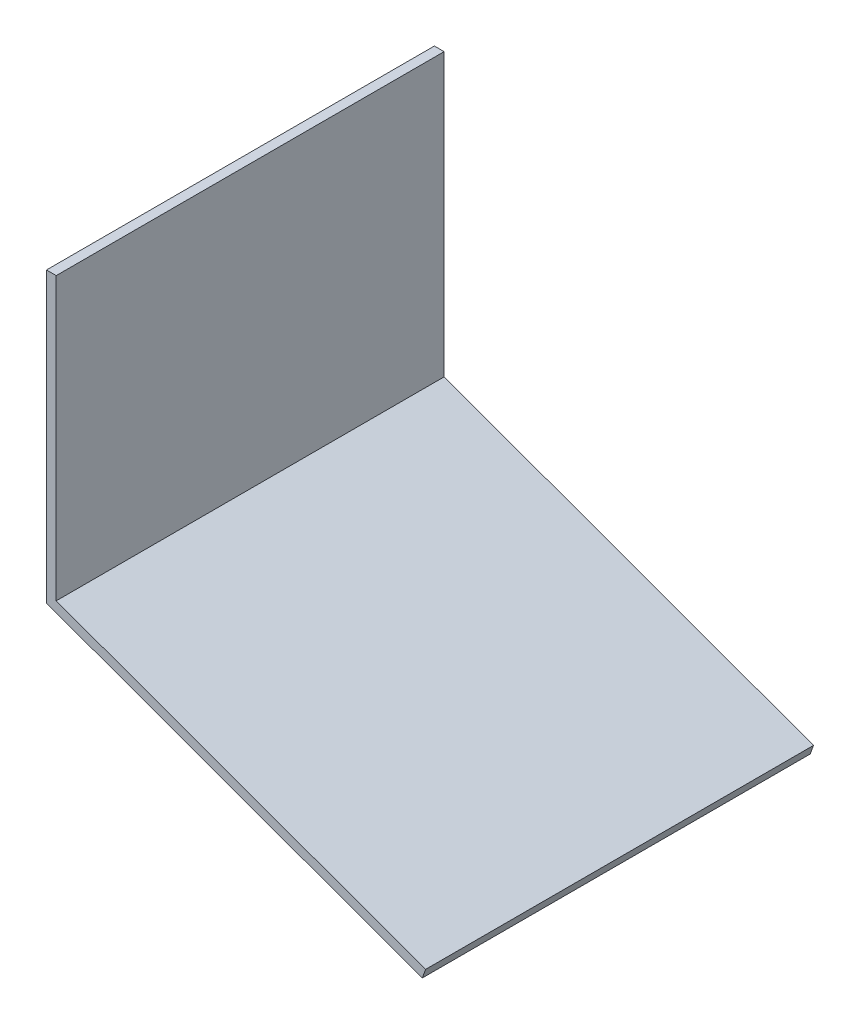
ISO-10303-21;
HEADER;
FILE_DESCRIPTION(('STEP AP214'),'2;1');
FILE_NAME('part.step','',(''),(''),'','','');
FILE_SCHEMA(('AUTOMOTIVE_DESIGN { 1 0 10303 214 1 1 1 1 }'));
ENDSEC;
DATA;
#1=APPLICATION_CONTEXT('core data for automotive mechanical design processes');
#2=APPLICATION_PROTOCOL_DEFINITION('international standard','automotive_design',2000,#1);
#3=PRODUCT_CONTEXT('',#1,'mechanical');
#4=PRODUCT('Part','Part','',(#3));
#5=PRODUCT_RELATED_PRODUCT_CATEGORY('part','',(#4));
#6=PRODUCT_DEFINITION_FORMATION('','',#4);
#7=PRODUCT_DEFINITION_CONTEXT('part definition',#1,'design');
#8=PRODUCT_DEFINITION('design','',#6,#7);
#9=PRODUCT_DEFINITION_SHAPE('','',#8);
#10=(LENGTH_UNIT() NAMED_UNIT(*) SI_UNIT(.MILLI.,.METRE.));
#11=(NAMED_UNIT(*) PLANE_ANGLE_UNIT() SI_UNIT($,.RADIAN.));
#12=(NAMED_UNIT(*) SI_UNIT($,.STERADIAN.) SOLID_ANGLE_UNIT());
#13=UNCERTAINTY_MEASURE_WITH_UNIT(LENGTH_MEASURE(1.E-05),#10,'distance_accuracy_value','');
#14=(GEOMETRIC_REPRESENTATION_CONTEXT(3) GLOBAL_UNCERTAINTY_ASSIGNED_CONTEXT((#13)) GLOBAL_UNIT_ASSIGNED_CONTEXT((#10,
#11,#12)) REPRESENTATION_CONTEXT('',''));
#15=CARTESIAN_POINT('',(0.,0.,0.));
#16=DIRECTION('',(0.,0.,1.));
#17=DIRECTION('',(1.,0.,0.));
#18=AXIS2_PLACEMENT_3D('',#15,#16,#17);
#19=CARTESIAN_POINT('',(-39.3731017802453,-108.176708075114,-469.281983346871));
#20=DIRECTION('',(0.342020143325665,0.93969262078591,0.));
#21=DIRECTION('',(-0.93969262078591,0.342020143325665,0.));
#22=AXIS2_PLACEMENT_3D('',#19,#20,#21);
#23=PLANE('',#22);
#24=DIRECTION('',(0.93969262078591,-0.342020143325665,0.));
#25=VECTOR('',#24,1.);
#26=CARTESIAN_POINT('',(-39.3731017802453,-108.176708075114,-177.));
#27=LINE('',#26,#25);
#28=CARTESIAN_POINT('',(-22.,-114.5,-177.));
#29=VERTEX_POINT('',#28);
#30=CARTESIAN_POINT('',(167.5,-183.472359393445,-177.));
#31=VERTEX_POINT('',#30);
#32=EDGE_CURVE('E48',#29,#31,#27,.T.);
#33=ORIENTED_EDGE('',*,*,#32,.F.);
#34=DIRECTION('',(0.,0.,1.));
#35=VECTOR('',#34,1.);
#36=CARTESIAN_POINT('',(-22.,-114.5,-469.281983346871));
#37=LINE('',#36,#35);
#38=CARTESIAN_POINT('',(-22.,-114.5,22.));
#39=VERTEX_POINT('',#38);
#40=EDGE_CURVE('E87',#29,#39,#37,.T.);
#41=ORIENTED_EDGE('',*,*,#40,.T.);
#42=DIRECTION('',(-0.93969262078591,0.342020143325665,0.));
#43=VECTOR('',#42,1.);
#44=CARTESIAN_POINT('',(-39.3731017802453,-108.176708075114,22.));
#45=LINE('',#44,#43);
#46=CARTESIAN_POINT('',(167.5,-183.472359393445,22.));
#47=VERTEX_POINT('',#46);
#48=EDGE_CURVE('E91',#47,#39,#45,.T.);
#49=ORIENTED_EDGE('',*,*,#48,.F.);
#50=DIRECTION('',(0.,0.,1.));
#51=VECTOR('',#50,1.);
#52=CARTESIAN_POINT('',(167.5,-183.472359393445,-469.281983346871));
#53=LINE('',#52,#51);
#54=EDGE_CURVE('E128',#31,#47,#53,.T.);
#55=ORIENTED_EDGE('',*,*,#54,.F.);
#56=EDGE_LOOP('',(#33,#41,#49,#55));
#57=FACE_BOUND('',#56,.T.);
#58=ADVANCED_FACE('F39',(#57),#23,.T.);
#59=CARTESIAN_POINT('',(206.873101780245,-75.2956513183295,-469.281983346871));
#60=DIRECTION('',(0.939692620785912,-0.34202014332566,0.));
#61=DIRECTION('',(0.34202014332566,0.939692620785912,0.));
#62=AXIS2_PLACEMENT_3D('',#59,#60,#61);
#63=PLANE('',#62);
#64=DIRECTION('',(-0.34202014332566,-0.939692620785912,0.));
#65=VECTOR('',#64,1.);
#66=CARTESIAN_POINT('',(206.873101780245,-75.2956513183295,-177.));
#67=LINE('',#66,#65);
#68=CARTESIAN_POINT('',(165.789899283372,-188.170822497374,-177.));
#69=VERTEX_POINT('',#68);
#70=EDGE_CURVE('E149',#31,#69,#67,.T.);
#71=ORIENTED_EDGE('',*,*,#70,.F.);
#72=ORIENTED_EDGE('',*,*,#54,.T.);
#73=DIRECTION('',(0.34202014332566,0.939692620785912,0.));
#74=VECTOR('',#73,1.);
#75=CARTESIAN_POINT('',(206.873101780245,-75.2956513183295,22.));
#76=LINE('',#75,#74);
#77=CARTESIAN_POINT('',(165.789899283372,-188.170822497374,22.));
#78=VERTEX_POINT('',#77);
#79=EDGE_CURVE('E98',#78,#47,#76,.T.);
#80=ORIENTED_EDGE('',*,*,#79,.F.);
#81=DIRECTION('',(0.,0.,1.));
#82=VECTOR('',#81,1.);
#83=CARTESIAN_POINT('',(165.789899283372,-188.170822497374,-469.281983346871));
#84=LINE('',#83,#82);
#85=EDGE_CURVE('E132',#69,#78,#84,.T.);
#86=ORIENTED_EDGE('',*,*,#85,.F.);
#87=EDGE_LOOP('',(#71,#72,#80,#86));
#88=FACE_BOUND('',#87,.T.);
#89=ADVANCED_FACE('F157',(#88),#63,.T.);
#90=CARTESIAN_POINT('',(-41.0832024968736,-112.875171179043,-469.281983346871));
#91=DIRECTION('',(-0.342020143325665,-0.93969262078591,0.));
#92=DIRECTION('',(0.93969262078591,-0.342020143325665,0.));
#93=AXIS2_PLACEMENT_3D('',#90,#91,#92);
#94=PLANE('',#93);
#95=DIRECTION('',(-0.93969262078591,0.342020143325665,0.));
#96=VECTOR('',#95,1.);
#97=CARTESIAN_POINT('',(-41.0832024968736,-112.875171179043,-177.));
#98=LINE('',#97,#96);
#99=CARTESIAN_POINT('',(-27.,-118.001037691049,-177.));
#100=VERTEX_POINT('',#99);
#101=EDGE_CURVE('E146',#69,#100,#98,.T.);
#102=ORIENTED_EDGE('',*,*,#101,.F.);
#103=ORIENTED_EDGE('',*,*,#85,.T.);
#104=DIRECTION('',(0.93969262078591,-0.342020143325665,0.));
#105=VECTOR('',#104,1.);
#106=CARTESIAN_POINT('',(-41.0832024968736,-112.875171179043,22.));
#107=LINE('',#106,#105);
#108=CARTESIAN_POINT('',(-27.,-118.001037691049,22.));
#109=VERTEX_POINT('',#108);
#110=EDGE_CURVE('E123',#109,#78,#107,.T.);
#111=ORIENTED_EDGE('',*,*,#110,.F.);
#112=DIRECTION('',(0.,0.,1.));
#113=VECTOR('',#112,1.);
#114=CARTESIAN_POINT('',(-27.,-118.001037691049,-469.281983346871));
#115=LINE('',#114,#113);
#116=EDGE_CURVE('E135',#100,#109,#115,.T.);
#117=ORIENTED_EDGE('',*,*,#116,.F.);
#118=EDGE_LOOP('',(#102,#103,#111,#117));
#119=FACE_BOUND('',#118,.T.);
#120=ADVANCED_FACE('F160',(#119),#94,.T.);
#121=CARTESIAN_POINT('',(-27.,0.,-469.281983346871));
#122=DIRECTION('',(-1.,0.,0.));
#123=DIRECTION('',(0.,-1.,0.));
#124=AXIS2_PLACEMENT_3D('',#121,#122,#123);
#125=PLANE('',#124);
#126=DIRECTION('',(0.,1.,0.));
#127=VECTOR('',#126,1.);
#128=CARTESIAN_POINT('',(-27.,0.,-177.));
#129=LINE('',#128,#127);
#130=CARTESIAN_POINT('',(-27.,30.,-177.));
#131=VERTEX_POINT('',#130);
#132=EDGE_CURVE('E55',#100,#131,#129,.T.);
#133=ORIENTED_EDGE('',*,*,#132,.F.);
#134=ORIENTED_EDGE('',*,*,#116,.T.);
#135=DIRECTION('',(0.,-1.,0.));
#136=VECTOR('',#135,1.);
#137=CARTESIAN_POINT('',(-27.,0.,22.));
#138=LINE('',#137,#136);
#139=CARTESIAN_POINT('',(-27.,30.,22.));
#140=VERTEX_POINT('',#139);
#141=EDGE_CURVE('E119',#140,#109,#138,.T.);
#142=ORIENTED_EDGE('',*,*,#141,.F.);
#143=DIRECTION('',(0.,0.,1.));
#144=VECTOR('',#143,1.);
#145=CARTESIAN_POINT('',(-27.,30.,-469.281983346871));
#146=LINE('',#145,#144);
#147=EDGE_CURVE('E138',#131,#140,#146,.T.);
#148=ORIENTED_EDGE('',*,*,#147,.F.);
#149=EDGE_LOOP('',(#133,#134,#142,#148));
#150=FACE_BOUND('',#149,.T.);
#151=ADVANCED_FACE('F165',(#150),#125,.T.);
#152=CARTESIAN_POINT('',(0.,30.,-469.281983346871));
#153=DIRECTION('',(0.,1.,0.));
#154=DIRECTION('',(0.,0.,1.));
#155=AXIS2_PLACEMENT_3D('',#152,#153,#154);
#156=PLANE('',#155);
#157=DIRECTION('',(1.,0.,0.));
#158=VECTOR('',#157,1.);
#159=CARTESIAN_POINT('',(0.,30.,-177.));
#160=LINE('',#159,#158);
#161=CARTESIAN_POINT('',(-22.,30.,-177.));
#162=VERTEX_POINT('',#161);
#163=EDGE_CURVE('E131',#131,#162,#160,.T.);
#164=ORIENTED_EDGE('',*,*,#163,.F.);
#165=ORIENTED_EDGE('',*,*,#147,.T.);
#166=DIRECTION('',(-1.,0.,0.));
#167=VECTOR('',#166,1.);
#168=CARTESIAN_POINT('',(0.,30.,22.));
#169=LINE('',#168,#167);
#170=CARTESIAN_POINT('',(-22.,30.,22.));
#171=VERTEX_POINT('',#170);
#172=EDGE_CURVE('E107',#171,#140,#169,.T.);
#173=ORIENTED_EDGE('',*,*,#172,.F.);
#174=DIRECTION('',(0.,0.,1.));
#175=VECTOR('',#174,1.);
#176=CARTESIAN_POINT('',(-22.,30.,-469.281983346871));
#177=LINE('',#176,#175);
#178=EDGE_CURVE('E97',#162,#171,#177,.T.);
#179=ORIENTED_EDGE('',*,*,#178,.F.);
#180=EDGE_LOOP('',(#164,#165,#173,#179));
#181=FACE_BOUND('',#180,.T.);
#182=ADVANCED_FACE('F167',(#181),#156,.T.);
#183=CARTESIAN_POINT('',(-22.,0.,-469.281983346871));
#184=DIRECTION('',(1.,0.,0.));
#185=DIRECTION('',(0.,1.,0.));
#186=AXIS2_PLACEMENT_3D('',#183,#184,#185);
#187=PLANE('',#186);
#188=DIRECTION('',(0.,-1.,0.));
#189=VECTOR('',#188,1.);
#190=CARTESIAN_POINT('',(-22.,0.,-177.));
#191=LINE('',#190,#189);
#192=EDGE_CURVE('E11',#162,#29,#191,.T.);
#193=ORIENTED_EDGE('',*,*,#192,.F.);
#194=ORIENTED_EDGE('',*,*,#178,.T.);
#195=DIRECTION('',(0.,1.,0.));
#196=VECTOR('',#195,1.);
#197=CARTESIAN_POINT('',(-22.,0.,22.));
#198=LINE('',#197,#196);
#199=EDGE_CURVE('E100',#39,#171,#198,.T.);
#200=ORIENTED_EDGE('',*,*,#199,.F.);
#201=ORIENTED_EDGE('',*,*,#40,.F.);
#202=EDGE_LOOP('',(#193,#194,#200,#201));
#203=FACE_BOUND('',#202,.T.);
#204=ADVANCED_FACE('F101',(#203),#187,.T.);
#205=CARTESIAN_POINT('',(0.,0.,22.));
#206=DIRECTION('',(0.,0.,-1.));
#207=DIRECTION('',(-1.,0.,0.));
#208=AXIS2_PLACEMENT_3D('',#205,#206,#207);
#209=PLANE('',#208);
#210=ORIENTED_EDGE('',*,*,#48,.T.);
#211=ORIENTED_EDGE('',*,*,#199,.T.);
#212=ORIENTED_EDGE('',*,*,#172,.T.);
#213=ORIENTED_EDGE('',*,*,#141,.T.);
#214=ORIENTED_EDGE('',*,*,#110,.T.);
#215=ORIENTED_EDGE('',*,*,#79,.T.);
#216=EDGE_LOOP('',(#210,#211,#212,#213,#214,#215));
#217=FACE_BOUND('',#216,.T.);
#218=ADVANCED_FACE('F109',(#217),#209,.F.);
#219=CARTESIAN_POINT('',(0.,0.,-177.));
#220=DIRECTION('',(0.,0.,1.));
#221=DIRECTION('',(-1.,0.,0.));
#222=AXIS2_PLACEMENT_3D('',#219,#220,#221);
#223=PLANE('',#222);
#224=ORIENTED_EDGE('',*,*,#32,.T.);
#225=ORIENTED_EDGE('',*,*,#70,.T.);
#226=ORIENTED_EDGE('',*,*,#101,.T.);
#227=ORIENTED_EDGE('',*,*,#132,.T.);
#228=ORIENTED_EDGE('',*,*,#163,.T.);
#229=ORIENTED_EDGE('',*,*,#192,.T.);
#230=EDGE_LOOP('',(#224,#225,#226,#227,#228,#229));
#231=FACE_BOUND('',#230,.T.);
#232=ADVANCED_FACE('F153',(#231),#223,.F.);
#233=CLOSED_SHELL('',(#58,#89,#120,#151,#182,#204,#218,#232));
#234=MANIFOLD_SOLID_BREP('B2',#233);
#235=ADVANCED_BREP_SHAPE_REPRESENTATION('',(#18,#234),#14);
#236=SHAPE_DEFINITION_REPRESENTATION(#9,#235);
ENDSEC;
END-ISO-10303-21;
